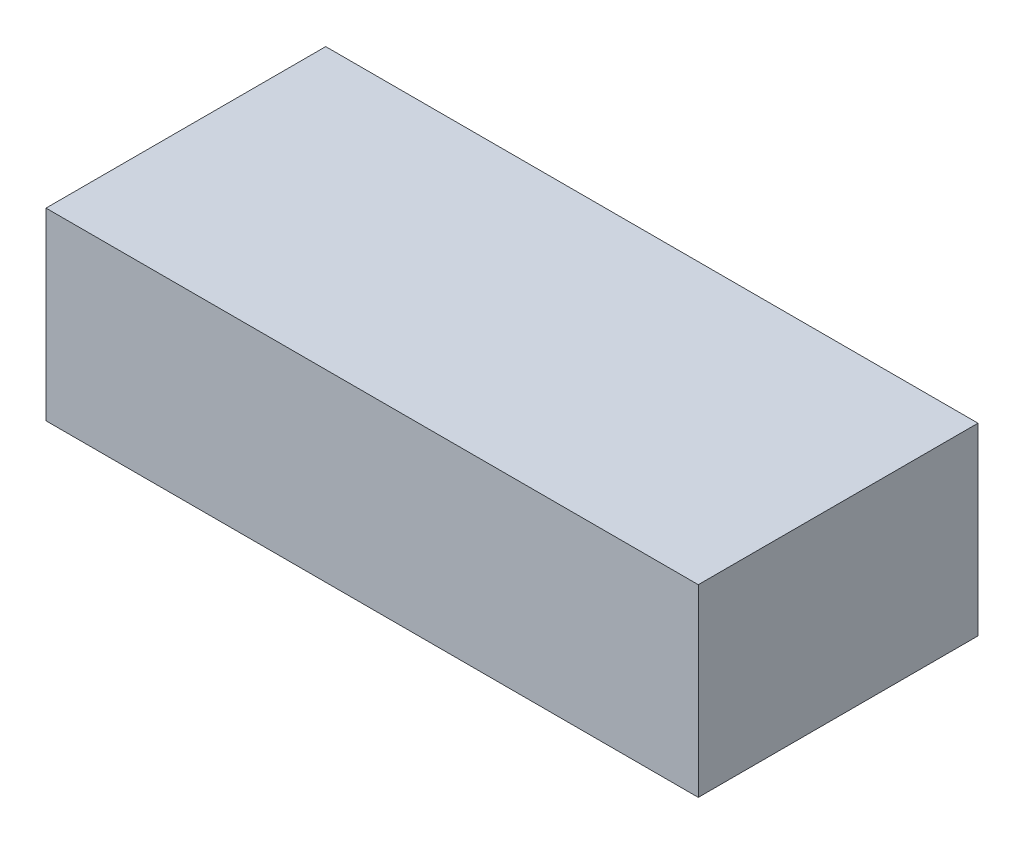
ISO-10303-21;
HEADER;
FILE_DESCRIPTION(('STEP AP214'),'2;1');
FILE_NAME('part.step','',(''),(''),'','','');
FILE_SCHEMA(('AUTOMOTIVE_DESIGN { 1 0 10303 214 1 1 1 1 }'));
ENDSEC;
DATA;
#1=APPLICATION_CONTEXT('core data for automotive mechanical design processes');
#2=APPLICATION_PROTOCOL_DEFINITION('international standard','automotive_design',2000,#1);
#3=PRODUCT_CONTEXT('',#1,'mechanical');
#4=PRODUCT('Part','Part','',(#3));
#5=PRODUCT_RELATED_PRODUCT_CATEGORY('part','',(#4));
#6=PRODUCT_DEFINITION_FORMATION('','',#4);
#7=PRODUCT_DEFINITION_CONTEXT('part definition',#1,'design');
#8=PRODUCT_DEFINITION('design','',#6,#7);
#9=PRODUCT_DEFINITION_SHAPE('','',#8);
#10=(LENGTH_UNIT() NAMED_UNIT(*) SI_UNIT(.MILLI.,.METRE.));
#11=(NAMED_UNIT(*) PLANE_ANGLE_UNIT() SI_UNIT($,.RADIAN.));
#12=(NAMED_UNIT(*) SI_UNIT($,.STERADIAN.) SOLID_ANGLE_UNIT());
#13=UNCERTAINTY_MEASURE_WITH_UNIT(LENGTH_MEASURE(1.E-05),#10,'distance_accuracy_value','');
#14=(GEOMETRIC_REPRESENTATION_CONTEXT(3) GLOBAL_UNCERTAINTY_ASSIGNED_CONTEXT((#13)) GLOBAL_UNIT_ASSIGNED_CONTEXT((#10,
#11,#12)) REPRESENTATION_CONTEXT('',''));
#15=CARTESIAN_POINT('',(0.,0.,0.));
#16=DIRECTION('',(0.,0.,1.));
#17=DIRECTION('',(1.,0.,0.));
#18=AXIS2_PLACEMENT_3D('',#15,#16,#17);
#19=CARTESIAN_POINT('',(-0.87449152,0.24699214,0.));
#20=DIRECTION('',(1.45227462341292E-06,0.999999999998946,0.));
#21=DIRECTION('',(0.999999999998946,-1.45227462341292E-06,0.));
#22=AXIS2_PLACEMENT_3D('',#19,#20,#21);
#23=PLANE('',#22);
#24=DIRECTION('',(0.,0.,1.));
#25=VECTOR('',#24,1.);
#26=CARTESIAN_POINT('',(-0.87449152,0.24699214,0.));
#27=LINE('',#26,#25);
#28=CARTESIAN_POINT('',(-0.87449152,0.24699214,0.));
#29=VERTEX_POINT('',#28);
#30=CARTESIAN_POINT('',(-0.87449152,0.24699214,0.75000104));
#31=VERTEX_POINT('',#30);
#32=EDGE_CURVE('E11',#29,#31,#27,.T.);
#33=ORIENTED_EDGE('',*,*,#32,.T.);
#34=DIRECTION('',(0.999999999998946,-1.45227462341292E-06,0.));
#35=VECTOR('',#34,1.);
#36=CARTESIAN_POINT('',(-0.87449152,0.24699214,0.75000104));
#37=LINE('',#36,#35);
#38=CARTESIAN_POINT('',(0.87448898,0.2469896,0.75000104));
#39=VERTEX_POINT('',#38);
#40=EDGE_CURVE('E24',#31,#39,#37,.T.);
#41=ORIENTED_EDGE('',*,*,#40,.T.);
#42=DIRECTION('',(0.,0.,1.));
#43=VECTOR('',#42,1.);
#44=CARTESIAN_POINT('',(0.87448898,0.2469896,0.));
#45=LINE('',#44,#43);
#46=CARTESIAN_POINT('',(0.87448898,0.2469896,0.));
#47=VERTEX_POINT('',#46);
#48=EDGE_CURVE('E85',#47,#39,#45,.T.);
#49=ORIENTED_EDGE('',*,*,#48,.F.);
#50=DIRECTION('',(0.999999999998946,-1.45227462341292E-06,0.));
#51=VECTOR('',#50,1.);
#52=CARTESIAN_POINT('',(-0.87449152,0.24699214,0.));
#53=LINE('',#52,#51);
#54=EDGE_CURVE('E83',#29,#47,#53,.T.);
#55=ORIENTED_EDGE('',*,*,#54,.F.);
#56=EDGE_LOOP('',(#33,#41,#49,#55));
#57=FACE_BOUND('',#56,.T.);
#58=ADVANCED_FACE('F17',(#57),#23,.T.);
#59=CARTESIAN_POINT('',(0.87448898,0.2469896,0.));
#60=DIRECTION('',(0.999999999986781,5.14189046130187E-06,0.));
#61=DIRECTION('',(5.14189046130187E-06,-0.999999999986781,0.));
#62=AXIS2_PLACEMENT_3D('',#59,#60,#61);
#63=PLANE('',#62);
#64=ORIENTED_EDGE('',*,*,#48,.T.);
#65=DIRECTION('',(5.14189046130187E-06,-0.999999999986781,0.));
#66=VECTOR('',#65,1.);
#67=CARTESIAN_POINT('',(0.87448898,0.2469896,0.75000104));
#68=LINE('',#67,#66);
#69=CARTESIAN_POINT('',(0.87449152,-0.24699214,0.75000104));
#70=VERTEX_POINT('',#69);
#71=EDGE_CURVE('E81',#39,#70,#68,.T.);
#72=ORIENTED_EDGE('',*,*,#71,.T.);
#73=DIRECTION('',(0.,0.,1.));
#74=VECTOR('',#73,1.);
#75=CARTESIAN_POINT('',(0.87449152,-0.24699214,0.));
#76=LINE('',#75,#74);
#77=CARTESIAN_POINT('',(0.87449152,-0.24699214,0.));
#78=VERTEX_POINT('',#77);
#79=EDGE_CURVE('E79',#78,#70,#76,.T.);
#80=ORIENTED_EDGE('',*,*,#79,.F.);
#81=DIRECTION('',(5.14189046130187E-06,-0.999999999986781,0.));
#82=VECTOR('',#81,1.);
#83=CARTESIAN_POINT('',(0.87448898,0.2469896,0.));
#84=LINE('',#83,#82);
#85=EDGE_CURVE('E70',#47,#78,#84,.T.);
#86=ORIENTED_EDGE('',*,*,#85,.F.);
#87=EDGE_LOOP('',(#64,#72,#80,#86));
#88=FACE_BOUND('',#87,.T.);
#89=ADVANCED_FACE('F90',(#88),#63,.T.);
#90=CARTESIAN_POINT('',(0.87449152,-0.24699214,0.));
#91=DIRECTION('',(0.,-1.,0.));
#92=DIRECTION('',(-1.,0.,0.));
#93=AXIS2_PLACEMENT_3D('',#90,#91,#92);
#94=PLANE('',#93);
#95=ORIENTED_EDGE('',*,*,#79,.T.);
#96=DIRECTION('',(-1.,0.,0.));
#97=VECTOR('',#96,1.);
#98=CARTESIAN_POINT('',(0.87449152,-0.24699214,0.75000104));
#99=LINE('',#98,#97);
#100=CARTESIAN_POINT('',(-0.87449152,-0.24699214,0.75000104));
#101=VERTEX_POINT('',#100);
#102=EDGE_CURVE('E60',#70,#101,#99,.T.);
#103=ORIENTED_EDGE('',*,*,#102,.T.);
#104=DIRECTION('',(0.,0.,1.));
#105=VECTOR('',#104,1.);
#106=CARTESIAN_POINT('',(-0.87449152,-0.24699214,0.));
#107=LINE('',#106,#105);
#108=CARTESIAN_POINT('',(-0.87449152,-0.24699214,0.));
#109=VERTEX_POINT('',#108);
#110=EDGE_CURVE('E54',#109,#101,#107,.T.);
#111=ORIENTED_EDGE('',*,*,#110,.F.);
#112=DIRECTION('',(-1.,0.,0.));
#113=VECTOR('',#112,1.);
#114=CARTESIAN_POINT('',(0.87449152,-0.24699214,0.));
#115=LINE('',#114,#113);
#116=EDGE_CURVE('E58',#78,#109,#115,.T.);
#117=ORIENTED_EDGE('',*,*,#116,.F.);
#118=EDGE_LOOP('',(#95,#103,#111,#117));
#119=FACE_BOUND('',#118,.T.);
#120=ADVANCED_FACE('F57',(#119),#94,.T.);
#121=CARTESIAN_POINT('',(-0.87449152,-0.24699214,0.));
#122=DIRECTION('',(-1.,0.,0.));
#123=DIRECTION('',(0.,1.,0.));
#124=AXIS2_PLACEMENT_3D('',#121,#122,#123);
#125=PLANE('',#124);
#126=ORIENTED_EDGE('',*,*,#110,.T.);
#127=DIRECTION('',(0.,1.,0.));
#128=VECTOR('',#127,1.);
#129=CARTESIAN_POINT('',(-0.87449152,-0.24699214,0.75000104));
#130=LINE('',#129,#128);
#131=EDGE_CURVE('E71',#101,#31,#130,.T.);
#132=ORIENTED_EDGE('',*,*,#131,.T.);
#133=ORIENTED_EDGE('',*,*,#32,.F.);
#134=DIRECTION('',(0.,1.,0.));
#135=VECTOR('',#134,1.);
#136=CARTESIAN_POINT('',(-0.87449152,-0.24699214,0.));
#137=LINE('',#136,#135);
#138=EDGE_CURVE('E68',#109,#29,#137,.T.);
#139=ORIENTED_EDGE('',*,*,#138,.F.);
#140=EDGE_LOOP('',(#126,#132,#133,#139));
#141=FACE_BOUND('',#140,.T.);
#142=ADVANCED_FACE('F73',(#141),#125,.T.);
#143=CARTESIAN_POINT('',(-0.87449152,0.24699214,0.));
#144=DIRECTION('',(0.,0.,1.));
#145=DIRECTION('',(1.,0.,0.));
#146=AXIS2_PLACEMENT_3D('',#143,#144,#145);
#147=PLANE('',#146);
#148=ORIENTED_EDGE('',*,*,#54,.T.);
#149=ORIENTED_EDGE('',*,*,#85,.T.);
#150=ORIENTED_EDGE('',*,*,#116,.T.);
#151=ORIENTED_EDGE('',*,*,#138,.T.);
#152=EDGE_LOOP('',(#148,#149,#150,#151));
#153=FACE_BOUND('',#152,.T.);
#154=ADVANCED_FACE('F67',(#153),#147,.F.);
#155=CARTESIAN_POINT('',(-0.87449152,0.24699214,0.75000104));
#156=DIRECTION('',(0.,0.,1.));
#157=DIRECTION('',(1.,0.,0.));
#158=AXIS2_PLACEMENT_3D('',#155,#156,#157);
#159=PLANE('',#158);
#160=ORIENTED_EDGE('',*,*,#131,.F.);
#161=ORIENTED_EDGE('',*,*,#102,.F.);
#162=ORIENTED_EDGE('',*,*,#71,.F.);
#163=ORIENTED_EDGE('',*,*,#40,.F.);
#164=EDGE_LOOP('',(#160,#161,#162,#163));
#165=FACE_BOUND('',#164,.T.);
#166=ADVANCED_FACE('F91',(#165),#159,.T.);
#167=CLOSED_SHELL('',(#58,#89,#120,#142,#154,#166));
#168=MANIFOLD_SOLID_BREP('B1',#167);
#169=ADVANCED_BREP_SHAPE_REPRESENTATION('',(#18,#168),#14);
#170=SHAPE_DEFINITION_REPRESENTATION(#9,#169);
ENDSEC;
END-ISO-10303-21;
